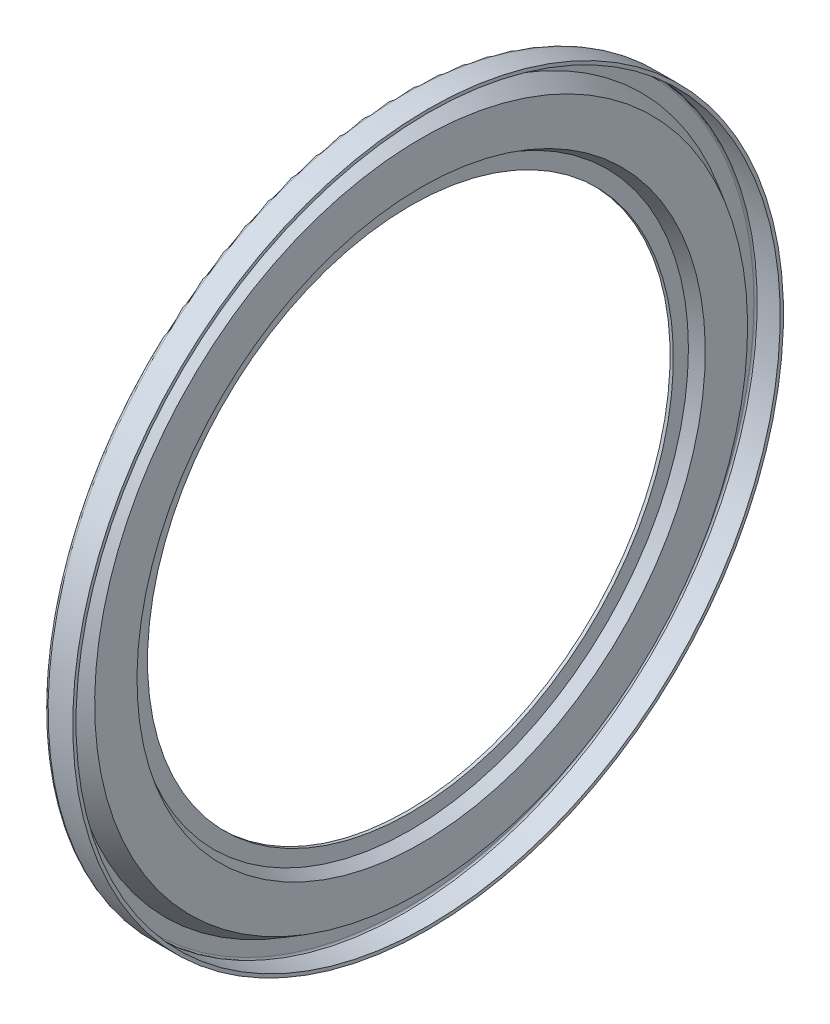
ISO-10303-21;
HEADER;
FILE_DESCRIPTION(('STEP AP214'),'2;1');
FILE_NAME('part.step','',(''),(''),'','','');
FILE_SCHEMA(('AUTOMOTIVE_DESIGN { 1 0 10303 214 1 1 1 1 }'));
ENDSEC;
DATA;
#1=APPLICATION_CONTEXT('core data for automotive mechanical design processes');
#2=APPLICATION_PROTOCOL_DEFINITION('international standard','automotive_design',2000,#1);
#3=PRODUCT_CONTEXT('',#1,'mechanical');
#4=PRODUCT('Part','Part','',(#3));
#5=PRODUCT_RELATED_PRODUCT_CATEGORY('part','',(#4));
#6=PRODUCT_DEFINITION_FORMATION('','',#4);
#7=PRODUCT_DEFINITION_CONTEXT('part definition',#1,'design');
#8=PRODUCT_DEFINITION('design','',#6,#7);
#9=PRODUCT_DEFINITION_SHAPE('','',#8);
#10=(LENGTH_UNIT() NAMED_UNIT(*) SI_UNIT(.MILLI.,.METRE.));
#11=(NAMED_UNIT(*) PLANE_ANGLE_UNIT() SI_UNIT($,.RADIAN.));
#12=(NAMED_UNIT(*) SI_UNIT($,.STERADIAN.) SOLID_ANGLE_UNIT());
#13=UNCERTAINTY_MEASURE_WITH_UNIT(LENGTH_MEASURE(1.E-05),#10,'distance_accuracy_value','');
#14=(GEOMETRIC_REPRESENTATION_CONTEXT(3) GLOBAL_UNCERTAINTY_ASSIGNED_CONTEXT((#13)) GLOBAL_UNIT_ASSIGNED_CONTEXT((#10,
#11,#12)) REPRESENTATION_CONTEXT('',''));
#15=CARTESIAN_POINT('',(0.,0.,0.));
#16=DIRECTION('',(0.,0.,1.));
#17=DIRECTION('',(1.,0.,0.));
#18=AXIS2_PLACEMENT_3D('',#15,#16,#17);
#19=CARTESIAN_POINT('',(10.11,0.,-20.8978257696894));
#20=DIRECTION('',(-1.,0.,0.));
#21=DIRECTION('',(0.,0.,1.));
#22=AXIS2_PLACEMENT_3D('',#19,#20,#21);
#23=PLANE('',#22);
#24=CARTESIAN_POINT('',(10.11,0.,0.));
#25=DIRECTION('',(1.,0.,0.));
#26=DIRECTION('',(0.,0.,-1.));
#27=AXIS2_PLACEMENT_3D('',#24,#25,#26);
#28=CIRCLE('',#27,21.425);
#29=CARTESIAN_POINT('',(10.11,0.,-21.425));
#30=VERTEX_POINT('',#29);
#31=EDGE_CURVE('E68',#30,#30,#28,.T.);
#32=ORIENTED_EDGE('',*,*,#31,.F.);
#33=EDGE_LOOP('',(#32));
#34=FACE_BOUND('',#33,.T.);
#35=CARTESIAN_POINT('',(10.11,0.,0.));
#36=DIRECTION('',(-1.,0.,0.));
#37=DIRECTION('',(0.,-1.,0.));
#38=AXIS2_PLACEMENT_3D('',#35,#36,#37);
#39=CIRCLE('',#38,20.3706515393788);
#40=CARTESIAN_POINT('',(10.11,-20.3706515393788,0.));
#41=VERTEX_POINT('',#40);
#42=EDGE_CURVE('E18',#41,#41,#39,.T.);
#43=ORIENTED_EDGE('',*,*,#42,.F.);
#44=EDGE_LOOP('',(#43));
#45=FACE_BOUND('',#44,.T.);
#46=ADVANCED_FACE('F14',(#34,#45),#23,.T.);
#47=CARTESIAN_POINT('',(10.31,0.,0.));
#48=DIRECTION('',(-1.,0.,0.));
#49=DIRECTION('',(0.,1.,0.));
#50=AXIS2_PLACEMENT_3D('',#47,#48,#49);
#51=TOROIDAL_SURFACE('',#50,21.425,0.199999999999999);
#52=CARTESIAN_POINT('',(10.31,0.,0.));
#53=DIRECTION('',(-1.,0.,0.));
#54=DIRECTION('',(0.,-1.,0.));
#55=AXIS2_PLACEMENT_3D('',#52,#53,#54);
#56=CIRCLE('',#55,21.625);
#57=CARTESIAN_POINT('',(10.31,-21.625,0.));
#58=VERTEX_POINT('',#57);
#59=EDGE_CURVE('E60',#58,#58,#56,.F.);
#60=ORIENTED_EDGE('',*,*,#59,.F.);
#61=EDGE_LOOP('',(#60));
#62=FACE_BOUND('',#61,.T.);
#63=ORIENTED_EDGE('',*,*,#31,.T.);
#64=EDGE_LOOP('',(#63));
#65=FACE_BOUND('',#64,.T.);
#66=ADVANCED_FACE('F77',(#62,#65),#51,.T.);
#67=CARTESIAN_POINT('',(11.185,0.,0.));
#68=DIRECTION('',(-1.,0.,0.));
#69=DIRECTION('',(0.,-1.,0.));
#70=AXIS2_PLACEMENT_3D('',#67,#68,#69);
#71=CONICAL_SURFACE('',#70,19.75,0.523598775598299);
#72=CARTESIAN_POINT('',(11.185,0.,0.));
#73=DIRECTION('',(-1.,0.,0.));
#74=DIRECTION('',(0.,-1.,0.));
#75=AXIS2_PLACEMENT_3D('',#72,#73,#74);
#76=CIRCLE('',#75,19.75);
#77=CARTESIAN_POINT('',(11.185,-19.75,0.));
#78=VERTEX_POINT('',#77);
#79=EDGE_CURVE('E58',#78,#78,#76,.T.);
#80=ORIENTED_EDGE('',*,*,#79,.F.);
#81=EDGE_LOOP('',(#80));
#82=FACE_BOUND('',#81,.T.);
#83=ORIENTED_EDGE('',*,*,#42,.T.);
#84=EDGE_LOOP('',(#83));
#85=FACE_BOUND('',#84,.T.);
#86=ADVANCED_FACE('F81',(#82,#85),#71,.F.);
#87=CARTESIAN_POINT('',(11.06,0.,0.));
#88=DIRECTION('',(-1.,0.,0.));
#89=DIRECTION('',(0.,-1.,0.));
#90=AXIS2_PLACEMENT_3D('',#87,#88,#89);
#91=CYLINDRICAL_SURFACE('',#90,21.625);
#92=ORIENTED_EDGE('',*,*,#59,.T.);
#93=EDGE_LOOP('',(#92));
#94=FACE_BOUND('',#93,.T.);
#95=CARTESIAN_POINT('',(11.81,0.,0.));
#96=DIRECTION('',(-1.,0.,0.));
#97=DIRECTION('',(0.,-1.,0.));
#98=AXIS2_PLACEMENT_3D('',#95,#96,#97);
#99=CIRCLE('',#98,21.625);
#100=CARTESIAN_POINT('',(11.81,-21.625,0.));
#101=VERTEX_POINT('',#100);
#102=EDGE_CURVE('E56',#101,#101,#99,.F.);
#103=ORIENTED_EDGE('',*,*,#102,.F.);
#104=EDGE_LOOP('',(#103));
#105=FACE_BOUND('',#104,.T.);
#106=ADVANCED_FACE('F85',(#94,#105),#91,.T.);
#107=CARTESIAN_POINT('',(11.185,0.,-18.578125));
#108=DIRECTION('',(-1.,0.,0.));
#109=DIRECTION('',(0.,-1.,0.));
#110=AXIS2_PLACEMENT_3D('',#107,#108,#109);
#111=PLANE('',#110);
#112=ORIENTED_EDGE('',*,*,#79,.T.);
#113=EDGE_LOOP('',(#112));
#114=FACE_BOUND('',#113,.T.);
#115=CARTESIAN_POINT('',(11.185,0.,0.));
#116=DIRECTION('',(1.,0.,0.));
#117=DIRECTION('',(0.,1.,0.));
#118=AXIS2_PLACEMENT_3D('',#115,#116,#117);
#119=CIRCLE('',#118,17.40625);
#120=CARTESIAN_POINT('',(11.185,17.40625,0.));
#121=VERTEX_POINT('',#120);
#122=EDGE_CURVE('E53',#121,#121,#119,.F.);
#123=ORIENTED_EDGE('',*,*,#122,.F.);
#124=EDGE_LOOP('',(#123));
#125=FACE_BOUND('',#124,.T.);
#126=ADVANCED_FACE('F89',(#114,#125),#111,.T.);
#127=CARTESIAN_POINT('',(11.81,0.,-21.525));
#128=DIRECTION('',(1.,0.,0.));
#129=DIRECTION('',(0.,1.,0.));
#130=AXIS2_PLACEMENT_3D('',#127,#128,#129);
#131=PLANE('',#130);
#132=CARTESIAN_POINT('',(11.81,0.,0.));
#133=DIRECTION('',(-1.,0.,0.));
#134=DIRECTION('',(0.,-1.,0.));
#135=AXIS2_PLACEMENT_3D('',#132,#133,#134);
#136=CIRCLE('',#135,21.425);
#137=CARTESIAN_POINT('',(11.81,-21.425,0.));
#138=VERTEX_POINT('',#137);
#139=EDGE_CURVE('E50',#138,#138,#136,.F.);
#140=ORIENTED_EDGE('',*,*,#139,.F.);
#141=EDGE_LOOP('',(#140));
#142=FACE_BOUND('',#141,.T.);
#143=ORIENTED_EDGE('',*,*,#102,.T.);
#144=EDGE_LOOP('',(#143));
#145=FACE_BOUND('',#144,.T.);
#146=ADVANCED_FACE('F92',(#142,#145),#131,.T.);
#147=CARTESIAN_POINT('',(11.185,0.,0.));
#148=DIRECTION('',(1.,0.,0.));
#149=DIRECTION('',(0.,1.,0.));
#150=AXIS2_PLACEMENT_3D('',#147,#148,#149);
#151=CONICAL_SURFACE('',#150,17.40625,0.5235987755983);
#152=CARTESIAN_POINT('',(10.535,0.,0.));
#153=DIRECTION('',(1.,0.,0.));
#154=DIRECTION('',(0.,1.,0.));
#155=AXIS2_PLACEMENT_3D('',#152,#153,#154);
#156=CIRCLE('',#155,17.0309723250267);
#157=CARTESIAN_POINT('',(10.535,17.0309723250267,0.));
#158=VERTEX_POINT('',#157);
#159=EDGE_CURVE('E47',#158,#158,#156,.F.);
#160=ORIENTED_EDGE('',*,*,#159,.F.);
#161=EDGE_LOOP('',(#160));
#162=FACE_BOUND('',#161,.T.);
#163=ORIENTED_EDGE('',*,*,#122,.T.);
#164=EDGE_LOOP('',(#163));
#165=FACE_BOUND('',#164,.T.);
#166=ADVANCED_FACE('F95',(#162,#165),#151,.T.);
#167=CARTESIAN_POINT('',(11.81,0.,0.));
#168=DIRECTION('',(-1.,0.,0.));
#169=DIRECTION('',(0.,-1.,0.));
#170=AXIS2_PLACEMENT_3D('',#167,#168,#169);
#171=CYLINDRICAL_SURFACE('',#170,21.425);
#172=ORIENTED_EDGE('',*,*,#139,.T.);
#173=EDGE_LOOP('',(#172));
#174=FACE_BOUND('',#173,.T.);
#175=CARTESIAN_POINT('',(10.41,0.,0.));
#176=DIRECTION('',(-1.,0.,0.));
#177=DIRECTION('',(0.,1.,0.));
#178=AXIS2_PLACEMENT_3D('',#175,#176,#177);
#179=CIRCLE('',#178,21.425);
#180=CARTESIAN_POINT('',(10.41,21.425,0.));
#181=VERTEX_POINT('',#180);
#182=EDGE_CURVE('E46',#181,#181,#179,.F.);
#183=ORIENTED_EDGE('',*,*,#182,.F.);
#184=EDGE_LOOP('',(#183));
#185=FACE_BOUND('',#184,.T.);
#186=ADVANCED_FACE('F99',(#174,#185),#171,.F.);
#187=CARTESIAN_POINT('',(10.535,0.,-16.5154861625134));
#188=DIRECTION('',(-1.,0.,0.));
#189=DIRECTION('',(0.,-1.,0.));
#190=AXIS2_PLACEMENT_3D('',#187,#188,#189);
#191=PLANE('',#190);
#192=ORIENTED_EDGE('',*,*,#159,.T.);
#193=EDGE_LOOP('',(#192));
#194=FACE_BOUND('',#193,.T.);
#195=CARTESIAN_POINT('',(10.535,0.,0.));
#196=DIRECTION('',(-1.,0.,0.));
#197=DIRECTION('',(0.,-1.,0.));
#198=AXIS2_PLACEMENT_3D('',#195,#196,#197);
#199=CIRCLE('',#198,16.);
#200=CARTESIAN_POINT('',(10.535,-16.,0.));
#201=VERTEX_POINT('',#200);
#202=EDGE_CURVE('E43',#201,#201,#199,.T.);
#203=ORIENTED_EDGE('',*,*,#202,.F.);
#204=EDGE_LOOP('',(#203));
#205=FACE_BOUND('',#204,.T.);
#206=ADVANCED_FACE('F103',(#194,#205),#191,.T.);
#207=CARTESIAN_POINT('',(10.41,0.,0.));
#208=DIRECTION('',(-1.,0.,0.));
#209=DIRECTION('',(0.,1.,0.));
#210=AXIS2_PLACEMENT_3D('',#207,#208,#209);
#211=TOROIDAL_SURFACE('',#210,21.325,0.100000000000003);
#212=CARTESIAN_POINT('',(10.31,0.,0.));
#213=DIRECTION('',(-1.,0.,0.));
#214=DIRECTION('',(0.,0.,-1.));
#215=AXIS2_PLACEMENT_3D('',#212,#213,#214);
#216=CIRCLE('',#215,21.325);
#217=CARTESIAN_POINT('',(10.31,0.,-21.325));
#218=VERTEX_POINT('',#217);
#219=EDGE_CURVE('E42',#218,#218,#216,.F.);
#220=ORIENTED_EDGE('',*,*,#219,.F.);
#221=EDGE_LOOP('',(#220));
#222=FACE_BOUND('',#221,.T.);
#223=ORIENTED_EDGE('',*,*,#182,.T.);
#224=EDGE_LOOP('',(#223));
#225=FACE_BOUND('',#224,.T.);
#226=ADVANCED_FACE('F107',(#222,#225),#211,.F.);
#227=CARTESIAN_POINT('',(10.735,0.,0.));
#228=DIRECTION('',(-1.,0.,0.));
#229=DIRECTION('',(0.,-1.,0.));
#230=AXIS2_PLACEMENT_3D('',#227,#228,#229);
#231=CYLINDRICAL_SURFACE('',#230,16.);
#232=CARTESIAN_POINT('',(10.735,0.,0.));
#233=DIRECTION('',(-1.,0.,0.));
#234=DIRECTION('',(0.,-1.,0.));
#235=AXIS2_PLACEMENT_3D('',#232,#233,#234);
#236=CIRCLE('',#235,16.);
#237=CARTESIAN_POINT('',(10.735,-16.,0.));
#238=VERTEX_POINT('',#237);
#239=EDGE_CURVE('E39',#238,#238,#236,.T.);
#240=ORIENTED_EDGE('',*,*,#239,.F.);
#241=EDGE_LOOP('',(#240));
#242=FACE_BOUND('',#241,.T.);
#243=ORIENTED_EDGE('',*,*,#202,.T.);
#244=EDGE_LOOP('',(#243));
#245=FACE_BOUND('',#244,.T.);
#246=ADVANCED_FACE('F113',(#242,#245),#231,.F.);
#247=CARTESIAN_POINT('',(10.31,0.,-20.9055607966084));
#248=DIRECTION('',(1.,0.,0.));
#249=DIRECTION('',(0.,1.,0.));
#250=AXIS2_PLACEMENT_3D('',#247,#248,#249);
#251=PLANE('',#250);
#252=CARTESIAN_POINT('',(10.31,0.,0.));
#253=DIRECTION('',(-1.,0.,0.));
#254=DIRECTION('',(0.,-1.,0.));
#255=AXIS2_PLACEMENT_3D('',#252,#253,#254);
#256=CIRCLE('',#255,20.4861215932168);
#257=CARTESIAN_POINT('',(10.31,-20.4861215932168,0.));
#258=VERTEX_POINT('',#257);
#259=EDGE_CURVE('E36',#258,#258,#256,.F.);
#260=ORIENTED_EDGE('',*,*,#259,.F.);
#261=EDGE_LOOP('',(#260));
#262=FACE_BOUND('',#261,.T.);
#263=ORIENTED_EDGE('',*,*,#219,.T.);
#264=EDGE_LOOP('',(#263));
#265=FACE_BOUND('',#264,.T.);
#266=ADVANCED_FACE('F137',(#262,#265),#251,.T.);
#267=CARTESIAN_POINT('',(10.735,0.,-16.4577511355944));
#268=DIRECTION('',(1.,0.,0.));
#269=DIRECTION('',(0.,1.,0.));
#270=AXIS2_PLACEMENT_3D('',#267,#268,#269);
#271=PLANE('',#270);
#272=ORIENTED_EDGE('',*,*,#239,.T.);
#273=EDGE_LOOP('',(#272));
#274=FACE_BOUND('',#273,.T.);
#275=CARTESIAN_POINT('',(10.735,0.,0.));
#276=DIRECTION('',(1.,0.,0.));
#277=DIRECTION('',(0.,1.,0.));
#278=AXIS2_PLACEMENT_3D('',#275,#276,#277);
#279=CIRCLE('',#278,16.9155022711888);
#280=CARTESIAN_POINT('',(10.735,16.9155022711888,0.));
#281=VERTEX_POINT('',#280);
#282=EDGE_CURVE('E27',#281,#281,#279,.F.);
#283=ORIENTED_EDGE('',*,*,#282,.F.);
#284=EDGE_LOOP('',(#283));
#285=FACE_BOUND('',#284,.T.);
#286=ADVANCED_FACE('F139',(#274,#285),#271,.T.);
#287=CARTESIAN_POINT('',(10.31,0.,0.));
#288=DIRECTION('',(-1.,0.,0.));
#289=DIRECTION('',(0.,-1.,0.));
#290=AXIS2_PLACEMENT_3D('',#287,#288,#289);
#291=CONICAL_SURFACE('',#290,20.4861215932168,0.523598775598299);
#292=ORIENTED_EDGE('',*,*,#259,.T.);
#293=EDGE_LOOP('',(#292));
#294=FACE_BOUND('',#293,.T.);
#295=CARTESIAN_POINT('',(11.385,0.,0.));
#296=DIRECTION('',(-1.,0.,0.));
#297=DIRECTION('',(0.,-1.,0.));
#298=AXIS2_PLACEMENT_3D('',#295,#296,#297);
#299=CIRCLE('',#298,19.8654700538379);
#300=CARTESIAN_POINT('',(11.385,-19.8654700538379,0.));
#301=VERTEX_POINT('',#300);
#302=EDGE_CURVE('E22',#301,#301,#299,.F.);
#303=ORIENTED_EDGE('',*,*,#302,.F.);
#304=EDGE_LOOP('',(#303));
#305=FACE_BOUND('',#304,.T.);
#306=ADVANCED_FACE('F146',(#294,#305),#291,.T.);
#307=CARTESIAN_POINT('',(10.735,0.,0.));
#308=DIRECTION('',(1.,0.,0.));
#309=DIRECTION('',(0.,1.,0.));
#310=AXIS2_PLACEMENT_3D('',#307,#308,#309);
#311=CONICAL_SURFACE('',#310,16.9155022711888,0.523598775598302);
#312=CARTESIAN_POINT('',(11.385,0.,0.));
#313=DIRECTION('',(1.,0.,0.));
#314=DIRECTION('',(0.,1.,0.));
#315=AXIS2_PLACEMENT_3D('',#312,#313,#314);
#316=CIRCLE('',#315,17.2907799461621);
#317=CARTESIAN_POINT('',(11.385,17.2907799461621,0.));
#318=VERTEX_POINT('',#317);
#319=EDGE_CURVE('E10',#318,#318,#316,.F.);
#320=ORIENTED_EDGE('',*,*,#319,.F.);
#321=EDGE_LOOP('',(#320));
#322=FACE_BOUND('',#321,.T.);
#323=ORIENTED_EDGE('',*,*,#282,.T.);
#324=EDGE_LOOP('',(#323));
#325=FACE_BOUND('',#324,.T.);
#326=ADVANCED_FACE('F154',(#322,#325),#311,.F.);
#327=CARTESIAN_POINT('',(11.385,0.,-18.578125));
#328=DIRECTION('',(1.,0.,0.));
#329=DIRECTION('',(0.,1.,0.));
#330=AXIS2_PLACEMENT_3D('',#327,#328,#329);
#331=PLANE('',#330);
#332=ORIENTED_EDGE('',*,*,#319,.T.);
#333=EDGE_LOOP('',(#332));
#334=FACE_BOUND('',#333,.T.);
#335=ORIENTED_EDGE('',*,*,#302,.T.);
#336=EDGE_LOOP('',(#335));
#337=FACE_BOUND('',#336,.T.);
#338=ADVANCED_FACE('F152',(#334,#337),#331,.T.);
#339=CLOSED_SHELL('',(#46,#66,#86,#106,#126,#146,#166,#186,#206,#226,#246,#266,#286,#306,#326,#338));
#340=MANIFOLD_SOLID_BREP('B1',#339);
#341=ADVANCED_BREP_SHAPE_REPRESENTATION('',(#18,#340),#14);
#342=SHAPE_DEFINITION_REPRESENTATION(#9,#341);
ENDSEC;
END-ISO-10303-21;
